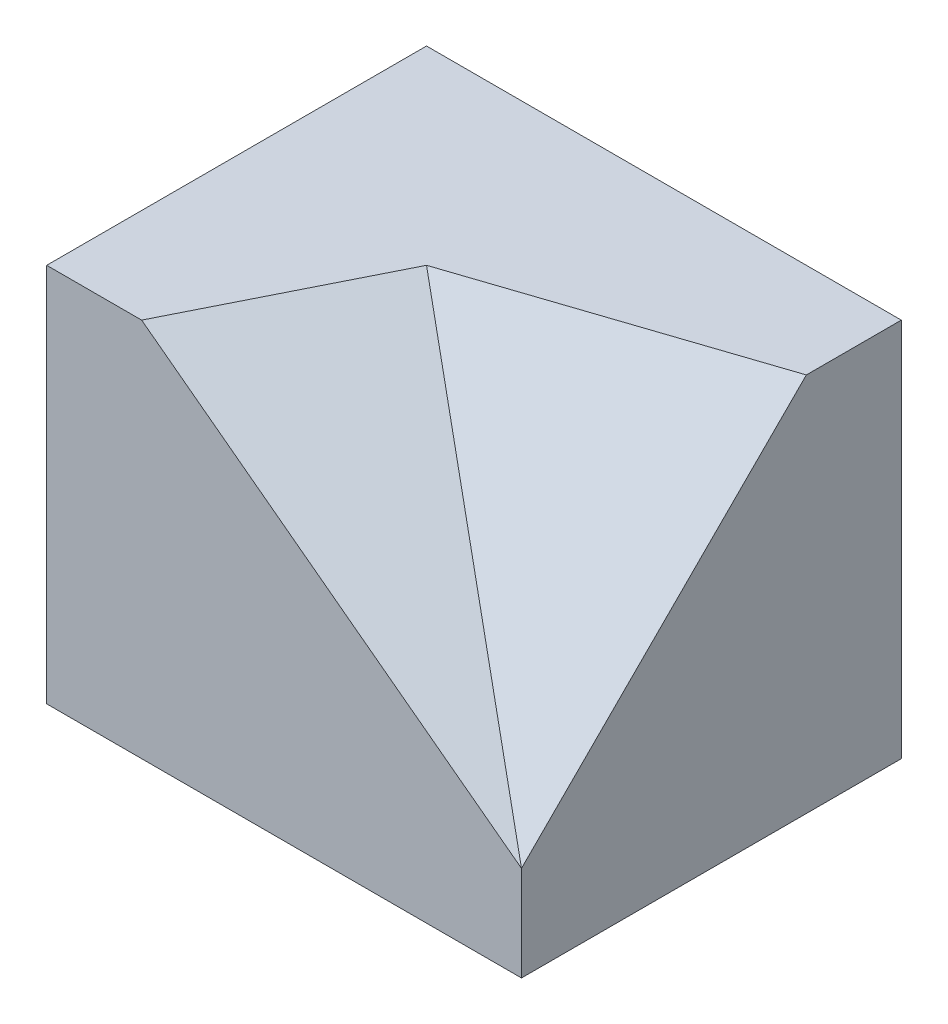
ISO-10303-21;
HEADER;
FILE_DESCRIPTION(('STEP AP214'),'2;1');
FILE_NAME('part.step','',(''),(''),'','','');
FILE_SCHEMA(('AUTOMOTIVE_DESIGN { 1 0 10303 214 1 1 1 1 }'));
ENDSEC;
DATA;
#1=APPLICATION_CONTEXT('core data for automotive mechanical design processes');
#2=APPLICATION_PROTOCOL_DEFINITION('international standard','automotive_design',2000,#1);
#3=PRODUCT_CONTEXT('',#1,'mechanical');
#4=PRODUCT('Part','Part','',(#3));
#5=PRODUCT_RELATED_PRODUCT_CATEGORY('part','',(#4));
#6=PRODUCT_DEFINITION_FORMATION('','',#4);
#7=PRODUCT_DEFINITION_CONTEXT('part definition',#1,'design');
#8=PRODUCT_DEFINITION('design','',#6,#7);
#9=PRODUCT_DEFINITION_SHAPE('','',#8);
#10=(LENGTH_UNIT() NAMED_UNIT(*) SI_UNIT(.MILLI.,.METRE.));
#11=(NAMED_UNIT(*) PLANE_ANGLE_UNIT() SI_UNIT($,.RADIAN.));
#12=(NAMED_UNIT(*) SI_UNIT($,.STERADIAN.) SOLID_ANGLE_UNIT());
#13=UNCERTAINTY_MEASURE_WITH_UNIT(LENGTH_MEASURE(1.E-05),#10,'distance_accuracy_value','');
#14=(GEOMETRIC_REPRESENTATION_CONTEXT(3) GLOBAL_UNCERTAINTY_ASSIGNED_CONTEXT((#13)) GLOBAL_UNIT_ASSIGNED_CONTEXT((#10,
#11,#12)) REPRESENTATION_CONTEXT('',''));
#15=CARTESIAN_POINT('',(0.,0.,0.));
#16=DIRECTION('',(0.,0.,1.));
#17=DIRECTION('',(1.,0.,0.));
#18=AXIS2_PLACEMENT_3D('',#15,#16,#17);
#19=CARTESIAN_POINT('',(25.,40.,20.));
#20=DIRECTION('',(-1.,0.,0.));
#21=DIRECTION('',(0.,0.,1.));
#22=AXIS2_PLACEMENT_3D('',#19,#20,#21);
#23=PLANE('',#22);
#24=DIRECTION('',(0.,0.,-1.));
#25=VECTOR('',#24,1.);
#26=CARTESIAN_POINT('',(25.,40.,20.));
#27=LINE('',#26,#25);
#28=CARTESIAN_POINT('',(25.,40.,-10.));
#29=VERTEX_POINT('',#28);
#30=CARTESIAN_POINT('',(25.,40.,-20.));
#31=VERTEX_POINT('',#30);
#32=EDGE_CURVE('E82',#29,#31,#27,.T.);
#33=ORIENTED_EDGE('',*,*,#32,.F.);
#34=DIRECTION('',(0.,-0.707106781186548,0.707106781186547));
#35=VECTOR('',#34,1.);
#36=CARTESIAN_POINT('',(25.,40.,-10.));
#37=LINE('',#36,#35);
#38=CARTESIAN_POINT('',(25.,9.99999999999999,20.));
#39=VERTEX_POINT('',#38);
#40=EDGE_CURVE('E90',#29,#39,#37,.T.);
#41=ORIENTED_EDGE('',*,*,#40,.T.);
#42=DIRECTION('',(0.,-1.,0.));
#43=VECTOR('',#42,1.);
#44=CARTESIAN_POINT('',(25.,40.,20.));
#45=LINE('',#44,#43);
#46=CARTESIAN_POINT('',(25.,0.,20.));
#47=VERTEX_POINT('',#46);
#48=EDGE_CURVE('E78',#39,#47,#45,.T.);
#49=ORIENTED_EDGE('',*,*,#48,.T.);
#50=DIRECTION('',(0.,0.,-1.));
#51=VECTOR('',#50,1.);
#52=CARTESIAN_POINT('',(25.,0.,20.));
#53=LINE('',#52,#51);
#54=CARTESIAN_POINT('',(25.,0.,-20.));
#55=VERTEX_POINT('',#54);
#56=EDGE_CURVE('E113',#47,#55,#53,.T.);
#57=ORIENTED_EDGE('',*,*,#56,.T.);
#58=DIRECTION('',(0.,-1.,0.));
#59=VECTOR('',#58,1.);
#60=CARTESIAN_POINT('',(25.,40.,-20.));
#61=LINE('',#60,#59);
#62=EDGE_CURVE('E11',#31,#55,#61,.T.);
#63=ORIENTED_EDGE('',*,*,#62,.F.);
#64=EDGE_LOOP('',(#33,#41,#49,#57,#63));
#65=FACE_BOUND('',#64,.T.);
#66=ADVANCED_FACE('F34',(#65),#23,.F.);
#67=CARTESIAN_POINT('',(0.,40.,0.));
#68=DIRECTION('',(0.,-1.,0.));
#69=DIRECTION('',(0.,0.,-1.));
#70=AXIS2_PLACEMENT_3D('',#67,#68,#69);
#71=PLANE('',#70);
#72=DIRECTION('',(-0.447213595499958,0.,0.894427190999916));
#73=VECTOR('',#72,1.);
#74=CARTESIAN_POINT('',(-15.,40.,20.));
#75=LINE('',#74,#73);
#76=CARTESIAN_POINT('',(-5.,40.,0.));
#77=VERTEX_POINT('',#76);
#78=CARTESIAN_POINT('',(-15.,40.,20.));
#79=VERTEX_POINT('',#78);
#80=EDGE_CURVE('E98',#77,#79,#75,.T.);
#81=ORIENTED_EDGE('',*,*,#80,.F.);
#82=DIRECTION('',(0.948683298050514,0.,-0.316227766016838));
#83=VECTOR('',#82,1.);
#84=CARTESIAN_POINT('',(-5.,40.,0.));
#85=LINE('',#84,#83);
#86=EDGE_CURVE('E48',#77,#29,#85,.T.);
#87=ORIENTED_EDGE('',*,*,#86,.T.);
#88=ORIENTED_EDGE('',*,*,#32,.T.);
#89=DIRECTION('',(-1.,0.,0.));
#90=VECTOR('',#89,1.);
#91=CARTESIAN_POINT('',(-25.,40.,-20.));
#92=LINE('',#91,#90);
#93=CARTESIAN_POINT('',(-25.,40.,-20.));
#94=VERTEX_POINT('',#93);
#95=EDGE_CURVE('E101',#31,#94,#92,.T.);
#96=ORIENTED_EDGE('',*,*,#95,.T.);
#97=DIRECTION('',(0.,0.,1.));
#98=VECTOR('',#97,1.);
#99=CARTESIAN_POINT('',(-25.,40.,20.));
#100=LINE('',#99,#98);
#101=CARTESIAN_POINT('',(-25.,40.,20.));
#102=VERTEX_POINT('',#101);
#103=EDGE_CURVE('E57',#94,#102,#100,.T.);
#104=ORIENTED_EDGE('',*,*,#103,.T.);
#105=DIRECTION('',(1.,0.,0.));
#106=VECTOR('',#105,1.);
#107=CARTESIAN_POINT('',(-25.,40.,20.));
#108=LINE('',#107,#106);
#109=EDGE_CURVE('E111',#102,#79,#108,.T.);
#110=ORIENTED_EDGE('',*,*,#109,.T.);
#111=EDGE_LOOP('',(#81,#87,#88,#96,#104,#110));
#112=FACE_BOUND('',#111,.T.);
#113=ADVANCED_FACE('F97',(#112),#71,.F.);
#114=CARTESIAN_POINT('',(-25.,40.,-20.));
#115=DIRECTION('',(0.,0.,1.));
#116=DIRECTION('',(1.,0.,0.));
#117=AXIS2_PLACEMENT_3D('',#114,#115,#116);
#118=PLANE('',#117);
#119=DIRECTION('',(-1.,0.,0.));
#120=VECTOR('',#119,1.);
#121=CARTESIAN_POINT('',(-25.,0.,-20.));
#122=LINE('',#121,#120);
#123=CARTESIAN_POINT('',(-25.,0.,-20.));
#124=VERTEX_POINT('',#123);
#125=EDGE_CURVE('E115',#55,#124,#122,.T.);
#126=ORIENTED_EDGE('',*,*,#125,.T.);
#127=DIRECTION('',(0.,-1.,0.));
#128=VECTOR('',#127,1.);
#129=CARTESIAN_POINT('',(-25.,40.,-20.));
#130=LINE('',#129,#128);
#131=EDGE_CURVE('E41',#94,#124,#130,.T.);
#132=ORIENTED_EDGE('',*,*,#131,.F.);
#133=ORIENTED_EDGE('',*,*,#95,.F.);
#134=ORIENTED_EDGE('',*,*,#62,.T.);
#135=EDGE_LOOP('',(#126,#132,#133,#134));
#136=FACE_BOUND('',#135,.T.);
#137=ADVANCED_FACE('F153',(#136),#118,.F.);
#138=CARTESIAN_POINT('',(-25.,40.,20.));
#139=DIRECTION('',(1.,0.,0.));
#140=DIRECTION('',(0.,0.,-1.));
#141=AXIS2_PLACEMENT_3D('',#138,#139,#140);
#142=PLANE('',#141);
#143=DIRECTION('',(0.,0.,1.));
#144=VECTOR('',#143,1.);
#145=CARTESIAN_POINT('',(-25.,0.,20.));
#146=LINE('',#145,#144);
#147=CARTESIAN_POINT('',(-25.,0.,20.));
#148=VERTEX_POINT('',#147);
#149=EDGE_CURVE('E105',#124,#148,#146,.T.);
#150=ORIENTED_EDGE('',*,*,#149,.T.);
#151=DIRECTION('',(0.,-1.,0.));
#152=VECTOR('',#151,1.);
#153=CARTESIAN_POINT('',(-25.,40.,20.));
#154=LINE('',#153,#152);
#155=EDGE_CURVE('E119',#102,#148,#154,.T.);
#156=ORIENTED_EDGE('',*,*,#155,.F.);
#157=ORIENTED_EDGE('',*,*,#103,.F.);
#158=ORIENTED_EDGE('',*,*,#131,.T.);
#159=EDGE_LOOP('',(#150,#156,#157,#158));
#160=FACE_BOUND('',#159,.T.);
#161=ADVANCED_FACE('F125',(#160),#142,.F.);
#162=CARTESIAN_POINT('',(-25.,40.,20.));
#163=DIRECTION('',(0.,0.,-1.));
#164=DIRECTION('',(-1.,0.,0.));
#165=AXIS2_PLACEMENT_3D('',#162,#163,#164);
#166=PLANE('',#165);
#167=ORIENTED_EDGE('',*,*,#48,.F.);
#168=DIRECTION('',(0.8,-0.6,0.));
#169=VECTOR('',#168,1.);
#170=CARTESIAN_POINT('',(25.,9.99999999999999,20.));
#171=LINE('',#170,#169);
#172=EDGE_CURVE('E94',#79,#39,#171,.T.);
#173=ORIENTED_EDGE('',*,*,#172,.F.);
#174=ORIENTED_EDGE('',*,*,#109,.F.);
#175=ORIENTED_EDGE('',*,*,#155,.T.);
#176=DIRECTION('',(1.,0.,0.));
#177=VECTOR('',#176,1.);
#178=CARTESIAN_POINT('',(-25.,0.,20.));
#179=LINE('',#178,#177);
#180=EDGE_CURVE('E102',#148,#47,#179,.T.);
#181=ORIENTED_EDGE('',*,*,#180,.T.);
#182=EDGE_LOOP('',(#167,#173,#174,#175,#181));
#183=FACE_BOUND('',#182,.T.);
#184=ADVANCED_FACE('F132',(#183),#166,.F.);
#185=CARTESIAN_POINT('',(0.,0.,0.));
#186=DIRECTION('',(0.,-1.,0.));
#187=DIRECTION('',(0.,0.,-1.));
#188=AXIS2_PLACEMENT_3D('',#185,#186,#187);
#189=PLANE('',#188);
#190=ORIENTED_EDGE('',*,*,#56,.F.);
#191=ORIENTED_EDGE('',*,*,#180,.F.);
#192=ORIENTED_EDGE('',*,*,#149,.F.);
#193=ORIENTED_EDGE('',*,*,#125,.F.);
#194=EDGE_LOOP('',(#190,#191,#192,#193));
#195=FACE_BOUND('',#194,.T.);
#196=ADVANCED_FACE('F130',(#195),#189,.T.);
#197=CARTESIAN_POINT('',(15.9633027522936,21.2844036697248,7.9816513761468));
#198=DIRECTION('',(-0.574695771132691,-0.766261028176921,-0.287347885566346));
#199=DIRECTION('',(0.8,-0.6,0.));
#200=AXIS2_PLACEMENT_3D('',#197,#198,#199);
#201=PLANE('',#200);
#202=ORIENTED_EDGE('',*,*,#172,.T.);
#203=DIRECTION('',(-0.639602149066831,0.639602149066831,-0.426401432711221));
#204=VECTOR('',#203,1.);
#205=CARTESIAN_POINT('',(-4.99999999999999,40.,0.));
#206=LINE('',#205,#204);
#207=EDGE_CURVE('E92',#39,#77,#206,.T.);
#208=ORIENTED_EDGE('',*,*,#207,.T.);
#209=ORIENTED_EDGE('',*,*,#80,.T.);
#210=EDGE_LOOP('',(#202,#208,#209));
#211=FACE_BOUND('',#210,.T.);
#212=ADVANCED_FACE('F137',(#211),#201,.F.);
#213=CARTESIAN_POINT('',(6.05263157894737,18.1578947368421,18.1578947368421));
#214=DIRECTION('',(-0.229415733870562,-0.688247201611685,-0.688247201611685));
#215=DIRECTION('',(0.,0.707106781186548,-0.707106781186547));
#216=AXIS2_PLACEMENT_3D('',#213,#214,#215);
#217=PLANE('',#216);
#218=ORIENTED_EDGE('',*,*,#207,.F.);
#219=ORIENTED_EDGE('',*,*,#40,.F.);
#220=ORIENTED_EDGE('',*,*,#86,.F.);
#221=EDGE_LOOP('',(#218,#219,#220));
#222=FACE_BOUND('',#221,.T.);
#223=ADVANCED_FACE('F91',(#222),#217,.F.);
#224=CLOSED_SHELL('',(#66,#113,#137,#161,#184,#196,#212,#223));
#225=MANIFOLD_SOLID_BREP('B2',#224);
#226=ADVANCED_BREP_SHAPE_REPRESENTATION('',(#18,#225),#14);
#227=SHAPE_DEFINITION_REPRESENTATION(#9,#226);
ENDSEC;
END-ISO-10303-21;
